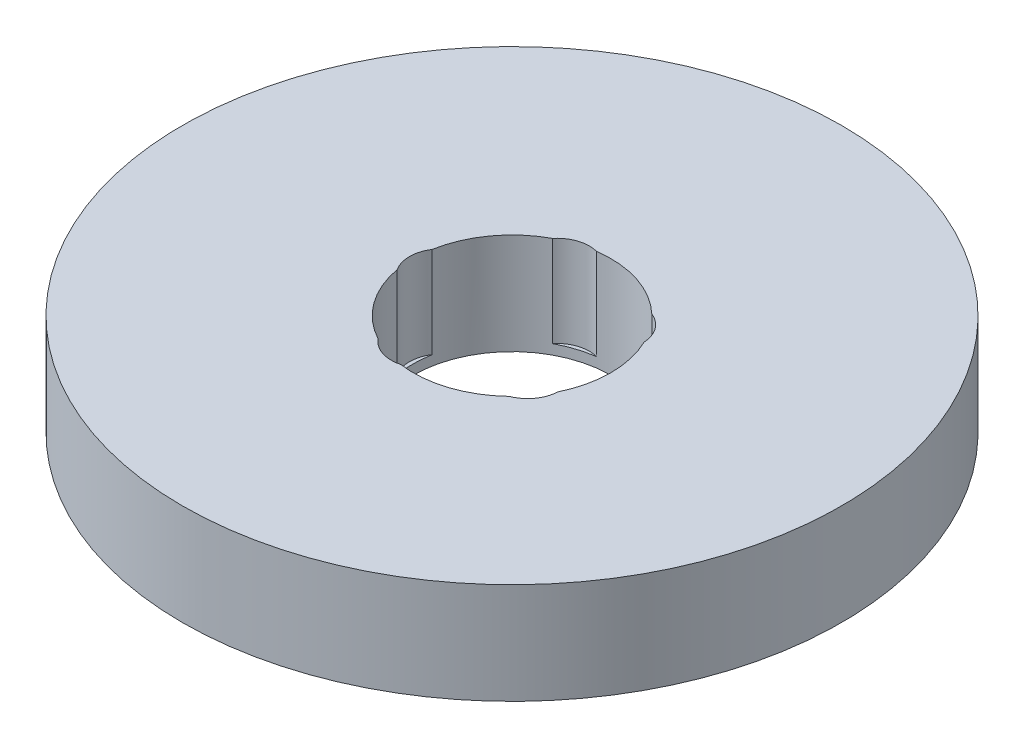
ISO-10303-21;
HEADER;
FILE_DESCRIPTION(('STEP AP214'),'2;1');
FILE_NAME('part.step','',(''),(''),'','','');
FILE_SCHEMA(('AUTOMOTIVE_DESIGN { 1 0 10303 214 1 1 1 1 }'));
ENDSEC;
DATA;
#1=APPLICATION_CONTEXT('core data for automotive mechanical design processes');
#2=APPLICATION_PROTOCOL_DEFINITION('international standard','automotive_design',2000,#1);
#3=PRODUCT_CONTEXT('',#1,'mechanical');
#4=PRODUCT('Part','Part','',(#3));
#5=PRODUCT_RELATED_PRODUCT_CATEGORY('part','',(#4));
#6=PRODUCT_DEFINITION_FORMATION('','',#4);
#7=PRODUCT_DEFINITION_CONTEXT('part definition',#1,'design');
#8=PRODUCT_DEFINITION('design','',#6,#7);
#9=PRODUCT_DEFINITION_SHAPE('','',#8);
#10=(LENGTH_UNIT() NAMED_UNIT(*) SI_UNIT(.MILLI.,.METRE.));
#11=(NAMED_UNIT(*) PLANE_ANGLE_UNIT() SI_UNIT($,.RADIAN.));
#12=(NAMED_UNIT(*) SI_UNIT($,.STERADIAN.) SOLID_ANGLE_UNIT());
#13=UNCERTAINTY_MEASURE_WITH_UNIT(LENGTH_MEASURE(1.E-05),#10,'distance_accuracy_value','');
#14=(GEOMETRIC_REPRESENTATION_CONTEXT(3) GLOBAL_UNCERTAINTY_ASSIGNED_CONTEXT((#13)) GLOBAL_UNIT_ASSIGNED_CONTEXT((#10,
#11,#12)) REPRESENTATION_CONTEXT('',''));
#15=CARTESIAN_POINT('',(0.,0.,0.));
#16=DIRECTION('',(0.,0.,1.));
#17=DIRECTION('',(1.,0.,0.));
#18=AXIS2_PLACEMENT_3D('',#15,#16,#17);
#19=CARTESIAN_POINT('',(0.,23.,0.));
#20=DIRECTION('',(0.,-1.,0.));
#21=DIRECTION('',(0.,0.,-1.));
#22=AXIS2_PLACEMENT_3D('',#19,#20,#21);
#23=CYLINDRICAL_SURFACE('',#22,75.);
#24=CARTESIAN_POINT('',(0.,23.,0.));
#25=DIRECTION('',(0.,1.,0.));
#26=DIRECTION('',(0.,0.,1.));
#27=AXIS2_PLACEMENT_3D('',#24,#25,#26);
#28=CIRCLE('',#27,75.);
#29=CARTESIAN_POINT('',(0.,23.,75.));
#30=VERTEX_POINT('',#29);
#31=EDGE_CURVE('E151',#30,#30,#28,.T.);
#32=ORIENTED_EDGE('',*,*,#31,.F.);
#33=EDGE_LOOP('',(#32));
#34=FACE_BOUND('',#33,.T.);
#35=CARTESIAN_POINT('',(0.,0.,0.));
#36=DIRECTION('',(0.,1.,0.));
#37=DIRECTION('',(0.,0.,1.));
#38=AXIS2_PLACEMENT_3D('',#35,#36,#37);
#39=CIRCLE('',#38,75.);
#40=CARTESIAN_POINT('',(0.,0.,75.));
#41=VERTEX_POINT('',#40);
#42=EDGE_CURVE('E150',#41,#41,#39,.T.);
#43=ORIENTED_EDGE('',*,*,#42,.T.);
#44=EDGE_LOOP('',(#43));
#45=FACE_BOUND('',#44,.T.);
#46=ADVANCED_FACE('F39',(#34,#45),#23,.T.);
#47=CARTESIAN_POINT('',(0.,23.,0.));
#48=DIRECTION('',(0.,1.,0.));
#49=DIRECTION('',(0.,0.,1.));
#50=AXIS2_PLACEMENT_3D('',#47,#48,#49);
#51=PLANE('',#50);
#52=CARTESIAN_POINT('',(-4.94629821159675,23.,-15.2231405757901));
#53=DIRECTION('',(0.,1.,0.));
#54=DIRECTION('',(-0.95105651629515,0.,0.309016994374958));
#55=AXIS2_PLACEMENT_3D('',#52,#53,#54);
#56=CIRCLE('',#55,7.31448377521004);
#57=CARTESIAN_POINT('',(-3.06181407476552,23.,-22.2906997326591));
#58=VERTEX_POINT('',#57);
#59=CARTESIAN_POINT('',(-10.6250849460355,23.,-19.8332440586388));
#60=VERTEX_POINT('',#59);
#61=EDGE_CURVE('E196',#58,#60,#56,.T.);
#62=ORIENTED_EDGE('',*,*,#61,.F.);
#63=CARTESIAN_POINT('',(0.,23.,0.));
#64=DIRECTION('',(0.,1.,0.));
#65=DIRECTION('',(0.,0.,1.));
#66=AXIS2_PLACEMENT_3D('',#63,#64,#65);
#67=CIRCLE('',#66,22.5);
#68=CARTESIAN_POINT('',(15.5792041862382,23.,-16.2338657418219));
#69=VERTEX_POINT('',#68);
#70=EDGE_CURVE('E156',#69,#58,#67,.T.);
#71=ORIENTED_EDGE('',*,*,#70,.F.);
#72=CARTESIAN_POINT('',(12.9495768364526,23.,-9.40841829135609));
#73=DIRECTION('',(0.,1.,0.));
#74=DIRECTION('',(-0.58778525229248,0.,-0.809016994374942));
#75=AXIS2_PLACEMENT_3D('',#72,#73,#74);
#76=CIRCLE('',#75,7.31448377521004);
#77=CARTESIAN_POINT('',(20.2535626508051,23.,-9.80016326139067));
#78=VERTEX_POINT('',#77);
#79=EDGE_CURVE('E254',#78,#69,#76,.T.);
#80=ORIENTED_EDGE('',*,*,#79,.F.);
#81=CARTESIAN_POINT('',(20.2535626508053,23.,9.80016326139038));
#82=VERTEX_POINT('',#81);
#83=EDGE_CURVE('E153',#82,#78,#67,.T.);
#84=ORIENTED_EDGE('',*,*,#83,.F.);
#85=CARTESIAN_POINT('',(12.9495768364527,23.,9.4084182913559));
#86=DIRECTION('',(0.,1.,0.));
#87=DIRECTION('',(0.587785252292469,0.,-0.809016994374951));
#88=AXIS2_PLACEMENT_3D('',#85,#86,#87);
#89=CIRCLE('',#88,7.31448377521004);
#90=CARTESIAN_POINT('',(15.5792041862384,23.,16.2338657418217));
#91=VERTEX_POINT('',#90);
#92=EDGE_CURVE('E248',#91,#82,#89,.T.);
#93=ORIENTED_EDGE('',*,*,#92,.F.);
#94=CARTESIAN_POINT('',(-3.0618140747652,23.,22.2906997326591));
#95=VERTEX_POINT('',#94);
#96=EDGE_CURVE('E140',#95,#91,#67,.T.);
#97=ORIENTED_EDGE('',*,*,#96,.F.);
#98=CARTESIAN_POINT('',(-4.94629821159653,23.,15.2231405757902));
#99=DIRECTION('',(0.,1.,0.));
#100=DIRECTION('',(0.951056516295155,0.,0.309016994374945));
#101=AXIS2_PLACEMENT_3D('',#98,#99,#100);
#102=CIRCLE('',#101,7.31448377521004);
#103=CARTESIAN_POINT('',(-10.6250849460352,23.,19.8332440586389));
#104=VERTEX_POINT('',#103);
#105=EDGE_CURVE('E117',#104,#95,#102,.T.);
#106=ORIENTED_EDGE('',*,*,#105,.F.);
#107=CARTESIAN_POINT('',(-22.145867816243,23.,3.97624680641104));
#108=VERTEX_POINT('',#107);
#109=EDGE_CURVE('E133',#108,#104,#67,.T.);
#110=ORIENTED_EDGE('',*,*,#109,.F.);
#111=CARTESIAN_POINT('',(-16.0065572497122,23.,0.));
#112=DIRECTION('',(0.,1.,0.));
#113=DIRECTION('',(0.,0.,1.));
#114=AXIS2_PLACEMENT_3D('',#111,#112,#113);
#115=CIRCLE('',#114,7.31448377521004);
#116=CARTESIAN_POINT('',(-22.145867816243,23.,-3.97624680641104));
#117=VERTEX_POINT('',#116);
#118=EDGE_CURVE('E170',#117,#108,#115,.T.);
#119=ORIENTED_EDGE('',*,*,#118,.F.);
#120=EDGE_CURVE('E149',#60,#117,#67,.T.);
#121=ORIENTED_EDGE('',*,*,#120,.F.);
#122=EDGE_LOOP('',(#62,#71,#80,#84,#93,#97,#106,#110,#119,#121));
#123=FACE_BOUND('',#122,.T.);
#124=ORIENTED_EDGE('',*,*,#31,.T.);
#125=EDGE_LOOP('',(#124));
#126=FACE_BOUND('',#125,.T.);
#127=ADVANCED_FACE('F131',(#123,#126),#51,.T.);
#128=CARTESIAN_POINT('',(0.,0.,0.));
#129=DIRECTION('',(0.,1.,0.));
#130=DIRECTION('',(0.,0.,1.));
#131=AXIS2_PLACEMENT_3D('',#128,#129,#130);
#132=PLANE('',#131);
#133=CARTESIAN_POINT('',(0.,0.,0.));
#134=DIRECTION('',(0.,1.,0.));
#135=DIRECTION('',(0.,0.,1.));
#136=AXIS2_PLACEMENT_3D('',#133,#134,#135);
#137=CIRCLE('',#136,22.5);
#138=CARTESIAN_POINT('',(0.,0.,22.5));
#139=VERTEX_POINT('',#138);
#140=EDGE_CURVE('E160',#139,#139,#137,.T.);
#141=ORIENTED_EDGE('',*,*,#140,.T.);
#142=EDGE_LOOP('',(#141));
#143=FACE_BOUND('',#142,.T.);
#144=ORIENTED_EDGE('',*,*,#42,.F.);
#145=EDGE_LOOP('',(#144));
#146=FACE_BOUND('',#145,.T.);
#147=ADVANCED_FACE('F212',(#143,#146),#132,.F.);
#148=CARTESIAN_POINT('',(0.,23.,0.));
#149=DIRECTION('',(0.,-1.,0.));
#150=DIRECTION('',(0.,0.,-1.));
#151=AXIS2_PLACEMENT_3D('',#148,#149,#150);
#152=CYLINDRICAL_SURFACE('',#151,22.5);
#153=DIRECTION('',(0.,1.,0.));
#154=VECTOR('',#153,1.);
#155=CARTESIAN_POINT('',(-3.06181407476553,12.6299872251302,-22.2906997326591));
#156=LINE('',#155,#154);
#157=CARTESIAN_POINT('',(-3.06181407476552,2.25997445026044,-22.2906997326591));
#158=VERTEX_POINT('',#157);
#159=EDGE_CURVE('E11',#158,#58,#156,.T.);
#160=ORIENTED_EDGE('',*,*,#159,.F.);
#161=CARTESIAN_POINT('',(0.,2.25997445026044,0.));
#162=DIRECTION('',(0.,1.,0.));
#163=DIRECTION('',(0.,0.,1.));
#164=AXIS2_PLACEMENT_3D('',#161,#162,#163);
#165=CIRCLE('',#164,22.5);
#166=CARTESIAN_POINT('',(-10.6250849460355,2.25997445026044,-19.8332440586388));
#167=VERTEX_POINT('',#166);
#168=EDGE_CURVE('E193',#158,#167,#165,.T.);
#169=ORIENTED_EDGE('',*,*,#168,.T.);
#170=DIRECTION('',(0.,1.,0.));
#171=VECTOR('',#170,1.);
#172=CARTESIAN_POINT('',(-10.6250849460355,12.6299872251302,-19.8332440586388));
#173=LINE('',#172,#171);
#174=EDGE_CURVE('E46',#60,#167,#173,.F.);
#175=ORIENTED_EDGE('',*,*,#174,.F.);
#176=ORIENTED_EDGE('',*,*,#120,.T.);
#177=DIRECTION('',(0.,1.,0.));
#178=VECTOR('',#177,1.);
#179=CARTESIAN_POINT('',(-22.145867816243,12.6299872251302,-3.97624680641104));
#180=LINE('',#179,#178);
#181=CARTESIAN_POINT('',(-22.145867816243,2.25997445026044,-3.97624680641104));
#182=VERTEX_POINT('',#181);
#183=EDGE_CURVE('E174',#182,#117,#180,.T.);
#184=ORIENTED_EDGE('',*,*,#183,.F.);
#185=CARTESIAN_POINT('',(0.,2.25997445026044,0.));
#186=DIRECTION('',(0.,1.,0.));
#187=DIRECTION('',(0.,0.,1.));
#188=AXIS2_PLACEMENT_3D('',#185,#186,#187);
#189=CIRCLE('',#188,22.5);
#190=CARTESIAN_POINT('',(-22.145867816243,2.25997445026044,3.97624680641104));
#191=VERTEX_POINT('',#190);
#192=EDGE_CURVE('E171',#182,#191,#189,.T.);
#193=ORIENTED_EDGE('',*,*,#192,.T.);
#194=DIRECTION('',(0.,1.,0.));
#195=VECTOR('',#194,1.);
#196=CARTESIAN_POINT('',(-22.145867816243,12.6299872251302,3.97624680641104));
#197=LINE('',#196,#195);
#198=EDGE_CURVE('E148',#108,#191,#197,.F.);
#199=ORIENTED_EDGE('',*,*,#198,.F.);
#200=ORIENTED_EDGE('',*,*,#109,.T.);
#201=DIRECTION('',(0.,1.,0.));
#202=VECTOR('',#201,1.);
#203=CARTESIAN_POINT('',(-10.6250849460352,12.6299872251302,19.8332440586389));
#204=LINE('',#203,#202);
#205=CARTESIAN_POINT('',(-10.6250849460352,2.25997445026044,19.8332440586389));
#206=VERTEX_POINT('',#205);
#207=EDGE_CURVE('E111',#206,#104,#204,.T.);
#208=ORIENTED_EDGE('',*,*,#207,.F.);
#209=CARTESIAN_POINT('',(0.,2.25997445026044,0.));
#210=DIRECTION('',(0.,1.,0.));
#211=DIRECTION('',(0.,0.,1.));
#212=AXIS2_PLACEMENT_3D('',#209,#210,#211);
#213=CIRCLE('',#212,22.5);
#214=CARTESIAN_POINT('',(-3.0618140747652,2.25997445026044,22.2906997326591));
#215=VERTEX_POINT('',#214);
#216=EDGE_CURVE('E180',#206,#215,#213,.T.);
#217=ORIENTED_EDGE('',*,*,#216,.T.);
#218=DIRECTION('',(0.,1.,0.));
#219=VECTOR('',#218,1.);
#220=CARTESIAN_POINT('',(-3.06181407476521,12.6299872251302,22.2906997326591));
#221=LINE('',#220,#219);
#222=EDGE_CURVE('E124',#95,#215,#221,.F.);
#223=ORIENTED_EDGE('',*,*,#222,.F.);
#224=ORIENTED_EDGE('',*,*,#96,.T.);
#225=DIRECTION('',(0.,1.,0.));
#226=VECTOR('',#225,1.);
#227=CARTESIAN_POINT('',(15.5792041862384,12.6299872251302,16.2338657418217));
#228=LINE('',#227,#226);
#229=CARTESIAN_POINT('',(15.5792041862384,2.25997445026044,16.2338657418217));
#230=VERTEX_POINT('',#229);
#231=EDGE_CURVE('E183',#230,#91,#228,.T.);
#232=ORIENTED_EDGE('',*,*,#231,.F.);
#233=CARTESIAN_POINT('',(0.,2.25997445026044,0.));
#234=DIRECTION('',(0.,1.,0.));
#235=DIRECTION('',(0.,0.,1.));
#236=AXIS2_PLACEMENT_3D('',#233,#234,#235);
#237=CIRCLE('',#236,22.5);
#238=CARTESIAN_POINT('',(20.2535626508053,2.25997445026044,9.80016326139038));
#239=VERTEX_POINT('',#238);
#240=EDGE_CURVE('E123',#230,#239,#237,.T.);
#241=ORIENTED_EDGE('',*,*,#240,.T.);
#242=DIRECTION('',(0.,1.,0.));
#243=VECTOR('',#242,1.);
#244=CARTESIAN_POINT('',(20.2535626508053,12.6299872251302,9.80016326139038));
#245=LINE('',#244,#243);
#246=EDGE_CURVE('E185',#82,#239,#245,.F.);
#247=ORIENTED_EDGE('',*,*,#246,.F.);
#248=ORIENTED_EDGE('',*,*,#83,.T.);
#249=DIRECTION('',(0.,1.,0.));
#250=VECTOR('',#249,1.);
#251=CARTESIAN_POINT('',(20.2535626508051,12.6299872251302,-9.80016326139068));
#252=LINE('',#251,#250);
#253=CARTESIAN_POINT('',(20.2535626508051,2.25997445026044,-9.80016326139067));
#254=VERTEX_POINT('',#253);
#255=EDGE_CURVE('E195',#254,#78,#252,.T.);
#256=ORIENTED_EDGE('',*,*,#255,.F.);
#257=CARTESIAN_POINT('',(0.,2.25997445026044,0.));
#258=DIRECTION('',(0.,1.,0.));
#259=DIRECTION('',(0.,0.,1.));
#260=AXIS2_PLACEMENT_3D('',#257,#258,#259);
#261=CIRCLE('',#260,22.5);
#262=CARTESIAN_POINT('',(15.5792041862382,2.25997445026044,-16.2338657418219));
#263=VERTEX_POINT('',#262);
#264=EDGE_CURVE('E190',#254,#263,#261,.T.);
#265=ORIENTED_EDGE('',*,*,#264,.T.);
#266=DIRECTION('',(0.,1.,0.));
#267=VECTOR('',#266,1.);
#268=CARTESIAN_POINT('',(15.5792041862382,12.6299872251302,-16.2338657418219));
#269=LINE('',#268,#267);
#270=EDGE_CURVE('E189',#69,#263,#269,.F.);
#271=ORIENTED_EDGE('',*,*,#270,.F.);
#272=ORIENTED_EDGE('',*,*,#70,.T.);
#273=EDGE_LOOP('',(#160,#169,#175,#176,#184,#193,#199,#200,#208,#217,#223,#224,#232,#241,#247,
#248,#256,#265,#271,#272));
#274=FACE_BOUND('',#273,.T.);
#275=ORIENTED_EDGE('',*,*,#140,.F.);
#276=EDGE_LOOP('',(#275));
#277=FACE_BOUND('',#276,.T.);
#278=ADVANCED_FACE('F142',(#274,#277),#152,.F.);
#279=CARTESIAN_POINT('',(-16.0065572497122,2.25997445026044,0.));
#280=DIRECTION('',(0.,1.,0.));
#281=DIRECTION('',(0.,0.,1.));
#282=AXIS2_PLACEMENT_3D('',#279,#280,#281);
#283=CYLINDRICAL_SURFACE('',#282,7.31448377521004);
#284=ORIENTED_EDGE('',*,*,#183,.T.);
#285=ORIENTED_EDGE('',*,*,#118,.T.);
#286=ORIENTED_EDGE('',*,*,#198,.T.);
#287=CARTESIAN_POINT('',(-16.0065572497122,2.25997445026044,0.));
#288=DIRECTION('',(0.,1.,0.));
#289=DIRECTION('',(0.,0.,1.));
#290=AXIS2_PLACEMENT_3D('',#287,#288,#289);
#291=CIRCLE('',#290,7.31448377521004);
#292=EDGE_CURVE('E163',#182,#191,#291,.T.);
#293=ORIENTED_EDGE('',*,*,#292,.F.);
#294=EDGE_LOOP('',(#284,#285,#286,#293));
#295=FACE_BOUND('',#294,.T.);
#296=ADVANCED_FACE('F221',(#295),#283,.F.);
#297=CARTESIAN_POINT('',(-16.0065572497122,2.25997445026044,0.));
#298=DIRECTION('',(0.,1.,0.));
#299=DIRECTION('',(0.,0.,1.));
#300=AXIS2_PLACEMENT_3D('',#297,#298,#299);
#301=PLANE('',#300);
#302=ORIENTED_EDGE('',*,*,#292,.T.);
#303=ORIENTED_EDGE('',*,*,#192,.F.);
#304=EDGE_LOOP('',(#302,#303));
#305=FACE_BOUND('',#304,.T.);
#306=ADVANCED_FACE('F227',(#305),#301,.T.);
#307=CARTESIAN_POINT('',(-4.94629821159653,2.25997445026044,15.2231405757902));
#308=DIRECTION('',(0.,1.,0.));
#309=DIRECTION('',(0.,0.,1.));
#310=AXIS2_PLACEMENT_3D('',#307,#308,#309);
#311=CYLINDRICAL_SURFACE('',#310,7.31448377521004);
#312=ORIENTED_EDGE('',*,*,#207,.T.);
#313=ORIENTED_EDGE('',*,*,#105,.T.);
#314=ORIENTED_EDGE('',*,*,#222,.T.);
#315=CARTESIAN_POINT('',(-4.94629821159653,2.25997445026044,15.2231405757902));
#316=DIRECTION('',(0.,1.,0.));
#317=DIRECTION('',(0.951056516295155,0.,0.309016994374945));
#318=AXIS2_PLACEMENT_3D('',#315,#316,#317);
#319=CIRCLE('',#318,7.31448377521004);
#320=EDGE_CURVE('E119',#206,#215,#319,.T.);
#321=ORIENTED_EDGE('',*,*,#320,.F.);
#322=EDGE_LOOP('',(#312,#313,#314,#321));
#323=FACE_BOUND('',#322,.T.);
#324=ADVANCED_FACE('F116',(#323),#311,.F.);
#325=CARTESIAN_POINT('',(-4.94629821159653,2.25997445026044,15.2231405757902));
#326=DIRECTION('',(0.,1.,0.));
#327=DIRECTION('',(0.951056516295155,0.,0.309016994374945));
#328=AXIS2_PLACEMENT_3D('',#325,#326,#327);
#329=PLANE('',#328);
#330=ORIENTED_EDGE('',*,*,#320,.T.);
#331=ORIENTED_EDGE('',*,*,#216,.F.);
#332=EDGE_LOOP('',(#330,#331));
#333=FACE_BOUND('',#332,.T.);
#334=ADVANCED_FACE('F234',(#333),#329,.T.);
#335=CARTESIAN_POINT('',(12.9495768364527,2.25997445026044,9.4084182913559));
#336=DIRECTION('',(0.,1.,0.));
#337=DIRECTION('',(0.,0.,1.));
#338=AXIS2_PLACEMENT_3D('',#335,#336,#337);
#339=CYLINDRICAL_SURFACE('',#338,7.31448377521004);
#340=ORIENTED_EDGE('',*,*,#231,.T.);
#341=ORIENTED_EDGE('',*,*,#92,.T.);
#342=ORIENTED_EDGE('',*,*,#246,.T.);
#343=CARTESIAN_POINT('',(12.9495768364527,2.25997445026044,9.4084182913559));
#344=DIRECTION('',(0.,1.,0.));
#345=DIRECTION('',(0.587785252292469,0.,-0.809016994374951));
#346=AXIS2_PLACEMENT_3D('',#343,#344,#345);
#347=CIRCLE('',#346,7.31448377521004);
#348=EDGE_CURVE('E137',#230,#239,#347,.T.);
#349=ORIENTED_EDGE('',*,*,#348,.F.);
#350=EDGE_LOOP('',(#340,#341,#342,#349));
#351=FACE_BOUND('',#350,.T.);
#352=ADVANCED_FACE('F240',(#351),#339,.F.);
#353=CARTESIAN_POINT('',(12.9495768364527,2.25997445026044,9.4084182913559));
#354=DIRECTION('',(0.,1.,0.));
#355=DIRECTION('',(0.587785252292469,0.,-0.809016994374951));
#356=AXIS2_PLACEMENT_3D('',#353,#354,#355);
#357=PLANE('',#356);
#358=ORIENTED_EDGE('',*,*,#348,.T.);
#359=ORIENTED_EDGE('',*,*,#240,.F.);
#360=EDGE_LOOP('',(#358,#359));
#361=FACE_BOUND('',#360,.T.);
#362=ADVANCED_FACE('F245',(#361),#357,.T.);
#363=CARTESIAN_POINT('',(12.9495768364526,2.25997445026044,-9.40841829135609));
#364=DIRECTION('',(0.,1.,0.));
#365=DIRECTION('',(0.,0.,1.));
#366=AXIS2_PLACEMENT_3D('',#363,#364,#365);
#367=CYLINDRICAL_SURFACE('',#366,7.31448377521004);
#368=ORIENTED_EDGE('',*,*,#255,.T.);
#369=ORIENTED_EDGE('',*,*,#79,.T.);
#370=ORIENTED_EDGE('',*,*,#270,.T.);
#371=CARTESIAN_POINT('',(12.9495768364526,2.25997445026044,-9.40841829135609));
#372=DIRECTION('',(0.,1.,0.));
#373=DIRECTION('',(-0.58778525229248,0.,-0.809016994374942));
#374=AXIS2_PLACEMENT_3D('',#371,#372,#373);
#375=CIRCLE('',#374,7.31448377521004);
#376=EDGE_CURVE('E56',#254,#263,#375,.T.);
#377=ORIENTED_EDGE('',*,*,#376,.F.);
#378=EDGE_LOOP('',(#368,#369,#370,#377));
#379=FACE_BOUND('',#378,.T.);
#380=ADVANCED_FACE('F264',(#379),#367,.F.);
#381=CARTESIAN_POINT('',(12.9495768364526,2.25997445026044,-9.40841829135609));
#382=DIRECTION('',(0.,1.,0.));
#383=DIRECTION('',(-0.58778525229248,0.,-0.809016994374942));
#384=AXIS2_PLACEMENT_3D('',#381,#382,#383);
#385=PLANE('',#384);
#386=ORIENTED_EDGE('',*,*,#376,.T.);
#387=ORIENTED_EDGE('',*,*,#264,.F.);
#388=EDGE_LOOP('',(#386,#387));
#389=FACE_BOUND('',#388,.T.);
#390=ADVANCED_FACE('F202',(#389),#385,.T.);
#391=CARTESIAN_POINT('',(-4.94629821159675,2.25997445026044,-15.2231405757901));
#392=DIRECTION('',(0.,1.,0.));
#393=DIRECTION('',(0.,0.,1.));
#394=AXIS2_PLACEMENT_3D('',#391,#392,#393);
#395=CYLINDRICAL_SURFACE('',#394,7.31448377521004);
#396=ORIENTED_EDGE('',*,*,#159,.T.);
#397=ORIENTED_EDGE('',*,*,#61,.T.);
#398=ORIENTED_EDGE('',*,*,#174,.T.);
#399=CARTESIAN_POINT('',(-4.94629821159675,2.25997445026044,-15.2231405757901));
#400=DIRECTION('',(0.,1.,0.));
#401=DIRECTION('',(-0.95105651629515,0.,0.309016994374958));
#402=AXIS2_PLACEMENT_3D('',#399,#400,#401);
#403=CIRCLE('',#402,7.31448377521004);
#404=EDGE_CURVE('E55',#158,#167,#403,.T.);
#405=ORIENTED_EDGE('',*,*,#404,.F.);
#406=EDGE_LOOP('',(#396,#397,#398,#405));
#407=FACE_BOUND('',#406,.T.);
#408=ADVANCED_FACE('F197',(#407),#395,.F.);
#409=CARTESIAN_POINT('',(-4.94629821159675,2.25997445026044,-15.2231405757901));
#410=DIRECTION('',(0.,1.,0.));
#411=DIRECTION('',(-0.95105651629515,0.,0.309016994374958));
#412=AXIS2_PLACEMENT_3D('',#409,#410,#411);
#413=PLANE('',#412);
#414=ORIENTED_EDGE('',*,*,#404,.T.);
#415=ORIENTED_EDGE('',*,*,#168,.F.);
#416=EDGE_LOOP('',(#414,#415));
#417=FACE_BOUND('',#416,.T.);
#418=ADVANCED_FACE('F200',(#417),#413,.T.);
#419=CLOSED_SHELL('',(#46,#127,#147,#278,#296,#306,#324,#334,#352,#362,#380,#390,#408,#418));
#420=MANIFOLD_SOLID_BREP('B2',#419);
#421=ADVANCED_BREP_SHAPE_REPRESENTATION('',(#18,#420),#14);
#422=SHAPE_DEFINITION_REPRESENTATION(#9,#421);
ENDSEC;
END-ISO-10303-21;
